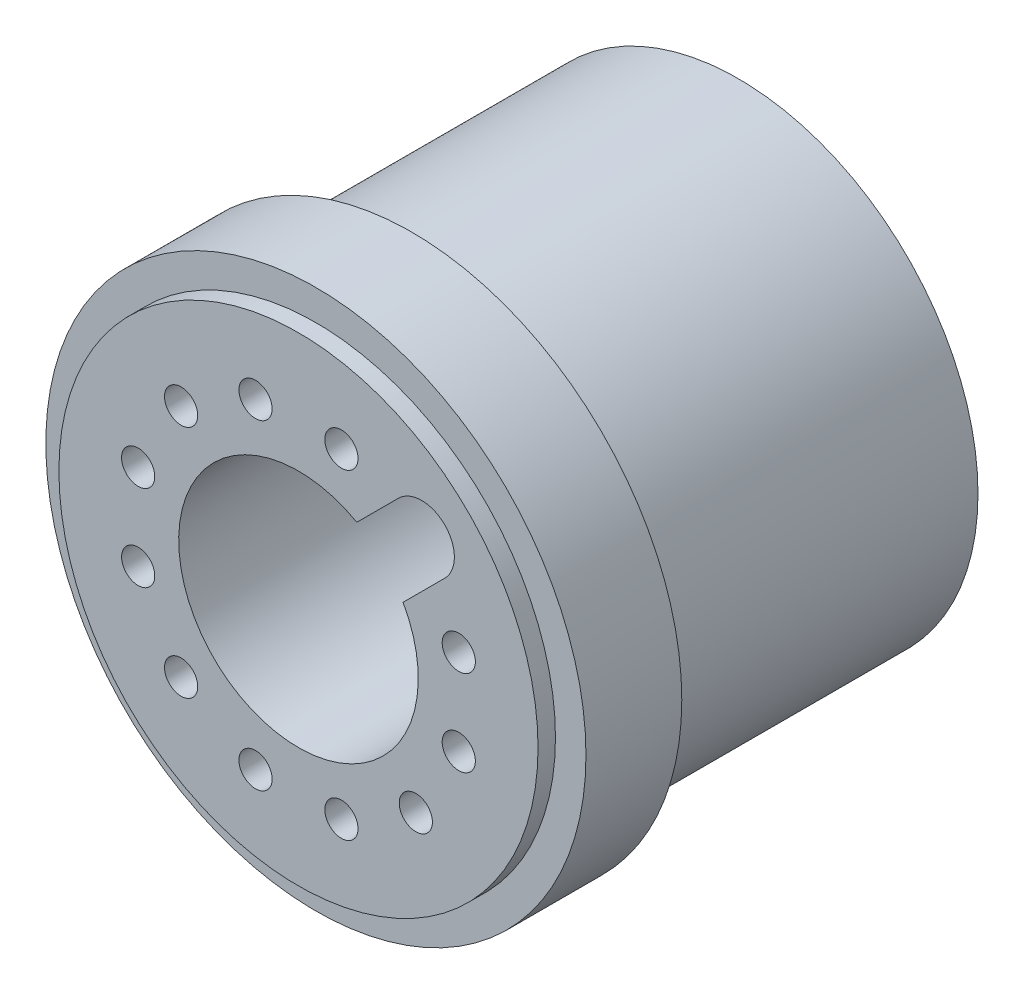
ISO-10303-21;
HEADER;
FILE_DESCRIPTION(('STEP AP214'),'2;1');
FILE_NAME('part.step','',(''),(''),'','','');
FILE_SCHEMA(('AUTOMOTIVE_DESIGN { 1 0 10303 214 1 1 1 1 }'));
ENDSEC;
DATA;
#1=APPLICATION_CONTEXT('core data for automotive mechanical design processes');
#2=APPLICATION_PROTOCOL_DEFINITION('international standard','automotive_design',2000,#1);
#3=PRODUCT_CONTEXT('',#1,'mechanical');
#4=PRODUCT('Part','Part','',(#3));
#5=PRODUCT_RELATED_PRODUCT_CATEGORY('part','',(#4));
#6=PRODUCT_DEFINITION_FORMATION('','',#4);
#7=PRODUCT_DEFINITION_CONTEXT('part definition',#1,'design');
#8=PRODUCT_DEFINITION('design','',#6,#7);
#9=PRODUCT_DEFINITION_SHAPE('','',#8);
#10=(LENGTH_UNIT() NAMED_UNIT(*) SI_UNIT(.MILLI.,.METRE.));
#11=(NAMED_UNIT(*) PLANE_ANGLE_UNIT() SI_UNIT($,.RADIAN.));
#12=(NAMED_UNIT(*) SI_UNIT($,.STERADIAN.) SOLID_ANGLE_UNIT());
#13=UNCERTAINTY_MEASURE_WITH_UNIT(LENGTH_MEASURE(1.E-05),#10,'distance_accuracy_value','');
#14=(GEOMETRIC_REPRESENTATION_CONTEXT(3) GLOBAL_UNCERTAINTY_ASSIGNED_CONTEXT((#13)) GLOBAL_UNIT_ASSIGNED_CONTEXT((#10,
#11,#12)) REPRESENTATION_CONTEXT('',''));
#15=CARTESIAN_POINT('',(0.,0.,0.));
#16=DIRECTION('',(0.,0.,1.));
#17=DIRECTION('',(1.,0.,0.));
#18=AXIS2_PLACEMENT_3D('',#15,#16,#17);
#19=CARTESIAN_POINT('',(0.,-21.1534369663591,2.2));
#20=DIRECTION('',(0.,0.,1.));
#21=DIRECTION('',(1.,0.,0.));
#22=AXIS2_PLACEMENT_3D('',#19,#20,#21);
#23=PLANE('',#22);
#24=CARTESIAN_POINT('',(0.,0.,2.2));
#25=DIRECTION('',(0.,0.,1.));
#26=DIRECTION('',(1.,0.,0.));
#27=AXIS2_PLACEMENT_3D('',#24,#25,#26);
#28=CIRCLE('',#27,6.2);
#29=CARTESIAN_POINT('',(6.2,0.,2.2));
#30=VERTEX_POINT('',#29);
#31=EDGE_CURVE('E12',#30,#30,#28,.T.);
#32=ORIENTED_EDGE('',*,*,#31,.T.);
#33=EDGE_LOOP('',(#32));
#34=FACE_BOUND('',#33,.T.);
#35=CARTESIAN_POINT('',(0.,0.,2.2));
#36=DIRECTION('',(0.,0.,1.));
#37=DIRECTION('',(1.,0.,0.));
#38=AXIS2_PLACEMENT_3D('',#35,#36,#37);
#39=CIRCLE('',#38,5.5);
#40=CARTESIAN_POINT('',(5.5,0.,2.2));
#41=VERTEX_POINT('',#40);
#42=EDGE_CURVE('E181',#41,#41,#39,.F.);
#43=ORIENTED_EDGE('',*,*,#42,.T.);
#44=EDGE_LOOP('',(#43));
#45=FACE_BOUND('',#44,.T.);
#46=ADVANCED_FACE('F35',(#34,#45),#23,.T.);
#47=CARTESIAN_POINT('',(0.,0.,2.2));
#48=DIRECTION('',(0.,0.,-1.));
#49=DIRECTION('',(-1.,0.,0.));
#50=AXIS2_PLACEMENT_3D('',#47,#48,#49);
#51=CYLINDRICAL_SURFACE('',#50,6.2);
#52=ORIENTED_EDGE('',*,*,#31,.F.);
#53=EDGE_LOOP('',(#52));
#54=FACE_BOUND('',#53,.T.);
#55=CARTESIAN_POINT('',(0.,0.,0.));
#56=DIRECTION('',(0.,0.,1.));
#57=DIRECTION('',(1.,0.,0.));
#58=AXIS2_PLACEMENT_3D('',#55,#56,#57);
#59=CIRCLE('',#58,6.2);
#60=CARTESIAN_POINT('',(6.2,0.,0.));
#61=VERTEX_POINT('',#60);
#62=EDGE_CURVE('E39',#61,#61,#59,.T.);
#63=ORIENTED_EDGE('',*,*,#62,.T.);
#64=EDGE_LOOP('',(#63));
#65=FACE_BOUND('',#64,.T.);
#66=ADVANCED_FACE('F37',(#54,#65),#51,.T.);
#67=CARTESIAN_POINT('',(0.,0.,2.2));
#68=DIRECTION('',(0.,0.,-1.));
#69=DIRECTION('',(-1.,0.,0.));
#70=AXIS2_PLACEMENT_3D('',#67,#68,#69);
#71=CYLINDRICAL_SURFACE('',#70,2.75);
#72=DIRECTION('',(0.,0.,1.));
#73=VECTOR('',#72,1.);
#74=CARTESIAN_POINT('',(2.40115877927687,1.34049860749707,0.6));
#75=LINE('',#74,#73);
#76=CARTESIAN_POINT('',(2.40115877927687,1.34049860749707,0.6));
#77=VERTEX_POINT('',#76);
#78=CARTESIAN_POINT('',(2.40115877927687,1.34049860749707,2.6));
#79=VERTEX_POINT('',#78);
#80=EDGE_CURVE('E87',#77,#79,#75,.T.);
#81=ORIENTED_EDGE('',*,*,#80,.F.);
#82=CARTESIAN_POINT('',(0.,0.,0.6));
#83=DIRECTION('',(0.,0.,1.));
#84=DIRECTION('',(1.,0.,0.));
#85=AXIS2_PLACEMENT_3D('',#82,#83,#84);
#86=CIRCLE('',#85,2.75);
#87=CARTESIAN_POINT('',(1.34049860749705,2.40115877927689,0.6));
#88=VERTEX_POINT('',#87);
#89=EDGE_CURVE('E93',#77,#88,#86,.T.);
#90=ORIENTED_EDGE('',*,*,#89,.T.);
#91=DIRECTION('',(0.,0.,1.));
#92=VECTOR('',#91,1.);
#93=CARTESIAN_POINT('',(1.34049860749705,2.40115877927689,0.6));
#94=LINE('',#93,#92);
#95=CARTESIAN_POINT('',(1.34049860749705,2.40115877927689,2.6));
#96=VERTEX_POINT('',#95);
#97=EDGE_CURVE('E79',#88,#96,#94,.T.);
#98=ORIENTED_EDGE('',*,*,#97,.T.);
#99=CARTESIAN_POINT('',(0.,0.,2.6));
#100=DIRECTION('',(0.,0.,1.));
#101=DIRECTION('',(1.,0.,0.));
#102=AXIS2_PLACEMENT_3D('',#99,#100,#101);
#103=CIRCLE('',#102,2.75);
#104=EDGE_CURVE('E175',#96,#79,#103,.T.);
#105=ORIENTED_EDGE('',*,*,#104,.T.);
#106=EDGE_LOOP('',(#81,#90,#98,#105));
#107=FACE_BOUND('',#106,.T.);
#108=CARTESIAN_POINT('',(0.,0.,-7.5));
#109=DIRECTION('',(0.,0.,1.));
#110=DIRECTION('',(1.,0.,0.));
#111=AXIS2_PLACEMENT_3D('',#108,#109,#110);
#112=CIRCLE('',#111,2.75);
#113=CARTESIAN_POINT('',(2.75,0.,-7.5));
#114=VERTEX_POINT('',#113);
#115=EDGE_CURVE('E186',#114,#114,#112,.T.);
#116=ORIENTED_EDGE('',*,*,#115,.F.);
#117=EDGE_LOOP('',(#116));
#118=FACE_BOUND('',#117,.T.);
#119=ADVANCED_FACE('F97',(#107,#118),#71,.F.);
#120=CARTESIAN_POINT('',(0.,-21.1534369663591,0.));
#121=DIRECTION('',(0.,0.,1.));
#122=DIRECTION('',(1.,0.,0.));
#123=AXIS2_PLACEMENT_3D('',#120,#121,#122);
#124=PLANE('',#123);
#125=CARTESIAN_POINT('',(0.,0.,0.));
#126=DIRECTION('',(0.,0.,1.));
#127=DIRECTION('',(1.,0.,0.));
#128=AXIS2_PLACEMENT_3D('',#125,#126,#127);
#129=CIRCLE('',#128,5.5);
#130=CARTESIAN_POINT('',(5.5,0.,0.));
#131=VERTEX_POINT('',#130);
#132=EDGE_CURVE('E185',#131,#131,#129,.T.);
#133=ORIENTED_EDGE('',*,*,#132,.T.);
#134=EDGE_LOOP('',(#133));
#135=FACE_BOUND('',#134,.T.);
#136=ORIENTED_EDGE('',*,*,#62,.F.);
#137=EDGE_LOOP('',(#136));
#138=FACE_BOUND('',#137,.T.);
#139=ADVANCED_FACE('F195',(#135,#138),#124,.F.);
#140=CARTESIAN_POINT('',(0.,0.,-7.5));
#141=DIRECTION('',(0.,0.,1.));
#142=DIRECTION('',(1.,0.,0.));
#143=AXIS2_PLACEMENT_3D('',#140,#141,#142);
#144=CYLINDRICAL_SURFACE('',#143,5.5);
#145=CARTESIAN_POINT('',(0.,0.,-7.5));
#146=DIRECTION('',(0.,0.,1.));
#147=DIRECTION('',(1.,0.,0.));
#148=AXIS2_PLACEMENT_3D('',#145,#146,#147);
#149=CIRCLE('',#148,5.5);
#150=CARTESIAN_POINT('',(5.5,0.,-7.5));
#151=VERTEX_POINT('',#150);
#152=EDGE_CURVE('E189',#151,#151,#149,.T.);
#153=ORIENTED_EDGE('',*,*,#152,.T.);
#154=EDGE_LOOP('',(#153));
#155=FACE_BOUND('',#154,.T.);
#156=ORIENTED_EDGE('',*,*,#132,.F.);
#157=EDGE_LOOP('',(#156));
#158=FACE_BOUND('',#157,.T.);
#159=ADVANCED_FACE('F198',(#155,#158),#144,.T.);
#160=CARTESIAN_POINT('',(0.,-21.1534369663591,-7.5));
#161=DIRECTION('',(0.,0.,1.));
#162=DIRECTION('',(1.,0.,0.));
#163=AXIS2_PLACEMENT_3D('',#160,#161,#162);
#164=PLANE('',#163);
#165=CARTESIAN_POINT('',(3.68017739816134,0.986100561840645,-7.5));
#166=DIRECTION('',(0.,0.,1.));
#167=DIRECTION('',(0.50000000000001,-0.866025403784433,0.));
#168=AXIS2_PLACEMENT_3D('',#165,#166,#167);
#169=CIRCLE('',#168,0.381);
#170=CARTESIAN_POINT('',(3.87067739816134,0.656144882998776,-7.5));
#171=VERTEX_POINT('',#170);
#172=EDGE_CURVE('E109',#171,#171,#169,.T.);
#173=ORIENTED_EDGE('',*,*,#172,.T.);
#174=EDGE_LOOP('',(#173));
#175=FACE_BOUND('',#174,.T.);
#176=CARTESIAN_POINT('',(3.68017739816136,-0.986100561840567,-7.5));
#177=DIRECTION('',(0.,0.,1.));
#178=DIRECTION('',(0.,-1.,0.));
#179=AXIS2_PLACEMENT_3D('',#176,#177,#178);
#180=CIRCLE('',#179,0.381);
#181=CARTESIAN_POINT('',(3.68017739816136,-1.36710056184057,-7.5));
#182=VERTEX_POINT('',#181);
#183=EDGE_CURVE('E117',#182,#182,#180,.T.);
#184=ORIENTED_EDGE('',*,*,#183,.T.);
#185=EDGE_LOOP('',(#184));
#186=FACE_BOUND('',#185,.T.);
#187=CARTESIAN_POINT('',(2.69407683632077,-2.69407683632072,-7.5));
#188=DIRECTION('',(0.,0.,1.));
#189=DIRECTION('',(-0.499999999999992,-0.866025403784443,0.));
#190=AXIS2_PLACEMENT_3D('',#187,#188,#189);
#191=CIRCLE('',#190,0.381);
#192=CARTESIAN_POINT('',(2.50357683632077,-3.0240325151626,-7.5));
#193=VERTEX_POINT('',#192);
#194=EDGE_CURVE('E123',#193,#193,#191,.T.);
#195=ORIENTED_EDGE('',*,*,#194,.T.);
#196=EDGE_LOOP('',(#195));
#197=FACE_BOUND('',#196,.T.);
#198=CARTESIAN_POINT('',(0.986100561840633,-3.68017739816134,-7.5));
#199=DIRECTION('',(0.,0.,1.));
#200=DIRECTION('',(-0.866025403784435,-0.500000000000007,0.));
#201=AXIS2_PLACEMENT_3D('',#198,#199,#200);
#202=CIRCLE('',#201,0.381);
#203=CARTESIAN_POINT('',(0.656144882998763,-3.87067739816135,-7.5));
#204=VERTEX_POINT('',#203);
#205=EDGE_CURVE('E129',#204,#204,#202,.T.);
#206=ORIENTED_EDGE('',*,*,#205,.T.);
#207=EDGE_LOOP('',(#206));
#208=FACE_BOUND('',#207,.T.);
#209=CARTESIAN_POINT('',(-0.98610056184058,-3.68017739816136,-7.5));
#210=DIRECTION('',(0.,0.,1.));
#211=DIRECTION('',(-1.,0.,0.));
#212=AXIS2_PLACEMENT_3D('',#209,#210,#211);
#213=CIRCLE('',#212,0.381);
#214=CARTESIAN_POINT('',(-1.36710056184058,-3.68017739816136,-7.5));
#215=VERTEX_POINT('',#214);
#216=EDGE_CURVE('E135',#215,#215,#213,.T.);
#217=ORIENTED_EDGE('',*,*,#216,.T.);
#218=EDGE_LOOP('',(#217));
#219=FACE_BOUND('',#218,.T.);
#220=CARTESIAN_POINT('',(-2.69407683632073,-2.69407683632076,-7.5));
#221=DIRECTION('',(0.,0.,1.));
#222=DIRECTION('',(-0.866025403784442,0.499999999999995,0.));
#223=AXIS2_PLACEMENT_3D('',#220,#221,#222);
#224=CIRCLE('',#223,0.381);
#225=CARTESIAN_POINT('',(-3.0240325151626,-2.50357683632076,-7.5));
#226=VERTEX_POINT('',#225);
#227=EDGE_CURVE('E141',#226,#226,#224,.T.);
#228=ORIENTED_EDGE('',*,*,#227,.T.);
#229=EDGE_LOOP('',(#228));
#230=FACE_BOUND('',#229,.T.);
#231=CARTESIAN_POINT('',(-3.68017739816135,-0.98610056184062,-7.5));
#232=DIRECTION('',(0.,0.,1.));
#233=DIRECTION('',(-0.500000000000004,0.866025403784436,0.));
#234=AXIS2_PLACEMENT_3D('',#231,#232,#233);
#235=CIRCLE('',#234,0.381);
#236=CARTESIAN_POINT('',(-3.87067739816135,-0.656144882998749,-7.5));
#237=VERTEX_POINT('',#236);
#238=EDGE_CURVE('E147',#237,#237,#235,.T.);
#239=ORIENTED_EDGE('',*,*,#238,.T.);
#240=EDGE_LOOP('',(#239));
#241=FACE_BOUND('',#240,.T.);
#242=CARTESIAN_POINT('',(-3.68017739816135,0.986100561840593,-7.5));
#243=DIRECTION('',(0.,0.,1.));
#244=DIRECTION('',(0.,1.,0.));
#245=AXIS2_PLACEMENT_3D('',#242,#243,#244);
#246=CIRCLE('',#245,0.381);
#247=CARTESIAN_POINT('',(-3.68017739816135,1.36710056184059,-7.5));
#248=VERTEX_POINT('',#247);
#249=EDGE_CURVE('E153',#248,#248,#246,.T.);
#250=ORIENTED_EDGE('',*,*,#249,.T.);
#251=EDGE_LOOP('',(#250));
#252=FACE_BOUND('',#251,.T.);
#253=CARTESIAN_POINT('',(-2.69407683632075,2.69407683632074,-7.5));
#254=DIRECTION('',(0.,0.,1.));
#255=DIRECTION('',(0.499999999999998,0.86602540378444,0.));
#256=AXIS2_PLACEMENT_3D('',#253,#254,#255);
#257=CIRCLE('',#256,0.381);
#258=CARTESIAN_POINT('',(-2.50357683632075,3.02403251516261,-7.5));
#259=VERTEX_POINT('',#258);
#260=EDGE_CURVE('E159',#259,#259,#257,.T.);
#261=ORIENTED_EDGE('',*,*,#260,.T.);
#262=EDGE_LOOP('',(#261));
#263=FACE_BOUND('',#262,.T.);
#264=CARTESIAN_POINT('',(-0.986100561840607,3.68017739816135,-7.5));
#265=DIRECTION('',(0.,0.,1.));
#266=DIRECTION('',(0.866025403784438,0.500000000000001,0.));
#267=AXIS2_PLACEMENT_3D('',#264,#265,#266);
#268=CIRCLE('',#267,0.381);
#269=CARTESIAN_POINT('',(-0.656144882998736,3.87067739816135,-7.5));
#270=VERTEX_POINT('',#269);
#271=EDGE_CURVE('E165',#270,#270,#268,.T.);
#272=ORIENTED_EDGE('',*,*,#271,.T.);
#273=EDGE_LOOP('',(#272));
#274=FACE_BOUND('',#273,.T.);
#275=CARTESIAN_POINT('',(0.986100561840606,3.68017739816135,-7.5));
#276=DIRECTION('',(0.,0.,1.));
#277=DIRECTION('',(1.,0.,0.));
#278=AXIS2_PLACEMENT_3D('',#275,#276,#277);
#279=CIRCLE('',#278,0.381);
#280=CARTESIAN_POINT('',(1.36710056184061,3.68017739816135,-7.5));
#281=VERTEX_POINT('',#280);
#282=EDGE_CURVE('E172',#281,#281,#279,.T.);
#283=ORIENTED_EDGE('',*,*,#282,.T.);
#284=EDGE_LOOP('',(#283));
#285=FACE_BOUND('',#284,.T.);
#286=ORIENTED_EDGE('',*,*,#115,.T.);
#287=EDGE_LOOP('',(#286));
#288=FACE_BOUND('',#287,.T.);
#289=ORIENTED_EDGE('',*,*,#152,.F.);
#290=EDGE_LOOP('',(#289));
#291=FACE_BOUND('',#290,.T.);
#292=ADVANCED_FACE('F200',(#175,#186,#197,#208,#219,#230,#241,#252,#263,#274,#285,#288,#291),
#164,.F.);
#293=CARTESIAN_POINT('',(0.,0.,18.556349186104));
#294=DIRECTION('',(0.,0.,-1.));
#295=DIRECTION('',(-1.,0.,0.));
#296=AXIS2_PLACEMENT_3D('',#293,#294,#295);
#297=CYLINDRICAL_SURFACE('',#296,5.5);
#298=ORIENTED_EDGE('',*,*,#42,.F.);
#299=EDGE_LOOP('',(#298));
#300=FACE_BOUND('',#299,.T.);
#301=CARTESIAN_POINT('',(0.,0.,2.6));
#302=DIRECTION('',(0.,0.,1.));
#303=DIRECTION('',(1.,0.,0.));
#304=AXIS2_PLACEMENT_3D('',#301,#302,#303);
#305=CIRCLE('',#304,5.5);
#306=CARTESIAN_POINT('',(5.5,0.,2.6));
#307=VERTEX_POINT('',#306);
#308=EDGE_CURVE('E178',#307,#307,#305,.T.);
#309=ORIENTED_EDGE('',*,*,#308,.F.);
#310=EDGE_LOOP('',(#309));
#311=FACE_BOUND('',#310,.T.);
#312=ADVANCED_FACE('F207',(#300,#311),#297,.T.);
#313=CARTESIAN_POINT('',(0.,-21.1534369663591,2.6));
#314=DIRECTION('',(0.,0.,1.));
#315=DIRECTION('',(1.,0.,0.));
#316=AXIS2_PLACEMENT_3D('',#313,#314,#315);
#317=PLANE('',#316);
#318=DIRECTION('',(0.707106781186543,0.707106781186552,0.));
#319=VECTOR('',#318,1.);
#320=CARTESIAN_POINT('',(-5.59038059222874,-6.65104076400863,2.6));
#321=LINE('',#320,#319);
#322=CARTESIAN_POINT('',(3.35875721063609,2.2980970388563,2.6));
#323=VERTEX_POINT('',#322);
#324=EDGE_CURVE('E106',#79,#323,#321,.T.);
#325=ORIENTED_EDGE('',*,*,#324,.F.);
#326=ORIENTED_EDGE('',*,*,#104,.F.);
#327=DIRECTION('',(0.707106781186543,0.707106781186552,0.));
#328=VECTOR('',#327,1.);
#329=CARTESIAN_POINT('',(-6.65104076400856,-5.59038059222882,2.6));
#330=LINE('',#329,#328);
#331=CARTESIAN_POINT('',(2.29809703885626,3.35875721063611,2.6));
#332=VERTEX_POINT('',#331);
#333=EDGE_CURVE('E82',#96,#332,#330,.T.);
#334=ORIENTED_EDGE('',*,*,#333,.T.);
#335=CARTESIAN_POINT('',(2.82842712474617,2.82842712474621,2.6));
#336=DIRECTION('',(0.,0.,1.));
#337=DIRECTION('',(1.,0.,0.));
#338=AXIS2_PLACEMENT_3D('',#335,#336,#337);
#339=CIRCLE('',#338,0.75);
#340=EDGE_CURVE('E50',#332,#323,#339,.F.);
#341=ORIENTED_EDGE('',*,*,#340,.T.);
#342=EDGE_LOOP('',(#325,#326,#334,#341));
#343=FACE_BOUND('',#342,.T.);
#344=CARTESIAN_POINT('',(3.68017739816134,0.986100561840645,2.6));
#345=DIRECTION('',(0.,0.,1.));
#346=DIRECTION('',(0.50000000000001,-0.866025403784433,0.));
#347=AXIS2_PLACEMENT_3D('',#344,#345,#346);
#348=CIRCLE('',#347,0.381);
#349=CARTESIAN_POINT('',(3.87067739816134,0.656144882998776,2.6));
#350=VERTEX_POINT('',#349);
#351=EDGE_CURVE('E114',#350,#350,#348,.T.);
#352=ORIENTED_EDGE('',*,*,#351,.F.);
#353=EDGE_LOOP('',(#352));
#354=FACE_BOUND('',#353,.T.);
#355=CARTESIAN_POINT('',(3.68017739816136,-0.986100561840567,2.6));
#356=DIRECTION('',(0.,0.,1.));
#357=DIRECTION('',(0.,-1.,0.));
#358=AXIS2_PLACEMENT_3D('',#355,#356,#357);
#359=CIRCLE('',#358,0.381);
#360=CARTESIAN_POINT('',(3.68017739816136,-1.36710056184057,2.6));
#361=VERTEX_POINT('',#360);
#362=EDGE_CURVE('E120',#361,#361,#359,.T.);
#363=ORIENTED_EDGE('',*,*,#362,.F.);
#364=EDGE_LOOP('',(#363));
#365=FACE_BOUND('',#364,.T.);
#366=CARTESIAN_POINT('',(2.69407683632077,-2.69407683632072,2.6));
#367=DIRECTION('',(0.,0.,1.));
#368=DIRECTION('',(-0.499999999999992,-0.866025403784443,0.));
#369=AXIS2_PLACEMENT_3D('',#366,#367,#368);
#370=CIRCLE('',#369,0.381);
#371=CARTESIAN_POINT('',(2.50357683632077,-3.0240325151626,2.6));
#372=VERTEX_POINT('',#371);
#373=EDGE_CURVE('E126',#372,#372,#370,.T.);
#374=ORIENTED_EDGE('',*,*,#373,.F.);
#375=EDGE_LOOP('',(#374));
#376=FACE_BOUND('',#375,.T.);
#377=CARTESIAN_POINT('',(0.986100561840633,-3.68017739816134,2.6));
#378=DIRECTION('',(0.,0.,1.));
#379=DIRECTION('',(-0.866025403784435,-0.500000000000007,0.));
#380=AXIS2_PLACEMENT_3D('',#377,#378,#379);
#381=CIRCLE('',#380,0.381);
#382=CARTESIAN_POINT('',(0.656144882998763,-3.87067739816135,2.6));
#383=VERTEX_POINT('',#382);
#384=EDGE_CURVE('E132',#383,#383,#381,.T.);
#385=ORIENTED_EDGE('',*,*,#384,.F.);
#386=EDGE_LOOP('',(#385));
#387=FACE_BOUND('',#386,.T.);
#388=CARTESIAN_POINT('',(-0.98610056184058,-3.68017739816136,2.6));
#389=DIRECTION('',(0.,0.,1.));
#390=DIRECTION('',(-1.,0.,0.));
#391=AXIS2_PLACEMENT_3D('',#388,#389,#390);
#392=CIRCLE('',#391,0.381);
#393=CARTESIAN_POINT('',(-1.36710056184058,-3.68017739816136,2.6));
#394=VERTEX_POINT('',#393);
#395=EDGE_CURVE('E138',#394,#394,#392,.T.);
#396=ORIENTED_EDGE('',*,*,#395,.F.);
#397=EDGE_LOOP('',(#396));
#398=FACE_BOUND('',#397,.T.);
#399=CARTESIAN_POINT('',(-2.69407683632073,-2.69407683632076,2.6));
#400=DIRECTION('',(0.,0.,1.));
#401=DIRECTION('',(-0.866025403784442,0.499999999999995,0.));
#402=AXIS2_PLACEMENT_3D('',#399,#400,#401);
#403=CIRCLE('',#402,0.381);
#404=CARTESIAN_POINT('',(-3.0240325151626,-2.50357683632076,2.6));
#405=VERTEX_POINT('',#404);
#406=EDGE_CURVE('E144',#405,#405,#403,.T.);
#407=ORIENTED_EDGE('',*,*,#406,.F.);
#408=EDGE_LOOP('',(#407));
#409=FACE_BOUND('',#408,.T.);
#410=CARTESIAN_POINT('',(-3.68017739816135,-0.98610056184062,2.6));
#411=DIRECTION('',(0.,0.,1.));
#412=DIRECTION('',(-0.500000000000004,0.866025403784436,0.));
#413=AXIS2_PLACEMENT_3D('',#410,#411,#412);
#414=CIRCLE('',#413,0.381);
#415=CARTESIAN_POINT('',(-3.87067739816135,-0.656144882998749,2.6));
#416=VERTEX_POINT('',#415);
#417=EDGE_CURVE('E150',#416,#416,#414,.T.);
#418=ORIENTED_EDGE('',*,*,#417,.F.);
#419=EDGE_LOOP('',(#418));
#420=FACE_BOUND('',#419,.T.);
#421=CARTESIAN_POINT('',(-3.68017739816135,0.986100561840593,2.6));
#422=DIRECTION('',(0.,0.,1.));
#423=DIRECTION('',(0.,1.,0.));
#424=AXIS2_PLACEMENT_3D('',#421,#422,#423);
#425=CIRCLE('',#424,0.381);
#426=CARTESIAN_POINT('',(-3.68017739816135,1.36710056184059,2.6));
#427=VERTEX_POINT('',#426);
#428=EDGE_CURVE('E156',#427,#427,#425,.T.);
#429=ORIENTED_EDGE('',*,*,#428,.F.);
#430=EDGE_LOOP('',(#429));
#431=FACE_BOUND('',#430,.T.);
#432=CARTESIAN_POINT('',(-2.69407683632075,2.69407683632074,2.6));
#433=DIRECTION('',(0.,0.,1.));
#434=DIRECTION('',(0.499999999999998,0.86602540378444,0.));
#435=AXIS2_PLACEMENT_3D('',#432,#433,#434);
#436=CIRCLE('',#435,0.381);
#437=CARTESIAN_POINT('',(-2.50357683632075,3.02403251516261,2.6));
#438=VERTEX_POINT('',#437);
#439=EDGE_CURVE('E162',#438,#438,#436,.T.);
#440=ORIENTED_EDGE('',*,*,#439,.F.);
#441=EDGE_LOOP('',(#440));
#442=FACE_BOUND('',#441,.T.);
#443=CARTESIAN_POINT('',(-0.986100561840607,3.68017739816135,2.6));
#444=DIRECTION('',(0.,0.,1.));
#445=DIRECTION('',(0.866025403784438,0.500000000000001,0.));
#446=AXIS2_PLACEMENT_3D('',#443,#444,#445);
#447=CIRCLE('',#446,0.381);
#448=CARTESIAN_POINT('',(-0.656144882998736,3.87067739816135,2.6));
#449=VERTEX_POINT('',#448);
#450=EDGE_CURVE('E168',#449,#449,#447,.T.);
#451=ORIENTED_EDGE('',*,*,#450,.F.);
#452=EDGE_LOOP('',(#451));
#453=FACE_BOUND('',#452,.T.);
#454=CARTESIAN_POINT('',(0.986100561840606,3.68017739816135,2.6));
#455=DIRECTION('',(0.,0.,1.));
#456=DIRECTION('',(1.,0.,0.));
#457=AXIS2_PLACEMENT_3D('',#454,#455,#456);
#458=CIRCLE('',#457,0.381);
#459=CARTESIAN_POINT('',(1.36710056184061,3.68017739816135,2.6));
#460=VERTEX_POINT('',#459);
#461=EDGE_CURVE('E171',#460,#460,#458,.T.);
#462=ORIENTED_EDGE('',*,*,#461,.F.);
#463=EDGE_LOOP('',(#462));
#464=FACE_BOUND('',#463,.T.);
#465=ORIENTED_EDGE('',*,*,#308,.T.);
#466=EDGE_LOOP('',(#465));
#467=FACE_BOUND('',#466,.T.);
#468=ADVANCED_FACE('F253',(#343,#354,#365,#376,#387,#398,#409,#420,#431,#442,#453,#464,#467),
#317,.T.);
#469=CARTESIAN_POINT('',(0.986100561840606,3.68017739816135,-7.5));
#470=DIRECTION('',(0.,0.,1.));
#471=DIRECTION('',(1.,0.,0.));
#472=AXIS2_PLACEMENT_3D('',#469,#470,#471);
#473=CYLINDRICAL_SURFACE('',#472,0.381);
#474=ORIENTED_EDGE('',*,*,#282,.F.);
#475=EDGE_LOOP('',(#474));
#476=FACE_BOUND('',#475,.T.);
#477=ORIENTED_EDGE('',*,*,#461,.T.);
#478=EDGE_LOOP('',(#477));
#479=FACE_BOUND('',#478,.T.);
#480=ADVANCED_FACE('F261',(#476,#479),#473,.F.);
#481=CARTESIAN_POINT('',(-0.986100561840607,3.68017739816135,-7.5));
#482=DIRECTION('',(0.,0.,1.));
#483=DIRECTION('',(0.866025403784438,0.500000000000001,0.));
#484=AXIS2_PLACEMENT_3D('',#481,#482,#483);
#485=CYLINDRICAL_SURFACE('',#484,0.381);
#486=ORIENTED_EDGE('',*,*,#271,.F.);
#487=EDGE_LOOP('',(#486));
#488=FACE_BOUND('',#487,.T.);
#489=ORIENTED_EDGE('',*,*,#450,.T.);
#490=EDGE_LOOP('',(#489));
#491=FACE_BOUND('',#490,.T.);
#492=ADVANCED_FACE('F266',(#488,#491),#485,.F.);
#493=CARTESIAN_POINT('',(-2.69407683632075,2.69407683632074,-7.5));
#494=DIRECTION('',(0.,0.,1.));
#495=DIRECTION('',(0.499999999999998,0.86602540378444,0.));
#496=AXIS2_PLACEMENT_3D('',#493,#494,#495);
#497=CYLINDRICAL_SURFACE('',#496,0.381);
#498=ORIENTED_EDGE('',*,*,#260,.F.);
#499=EDGE_LOOP('',(#498));
#500=FACE_BOUND('',#499,.T.);
#501=ORIENTED_EDGE('',*,*,#439,.T.);
#502=EDGE_LOOP('',(#501));
#503=FACE_BOUND('',#502,.T.);
#504=ADVANCED_FACE('F281',(#500,#503),#497,.F.);
#505=CARTESIAN_POINT('',(-3.68017739816135,0.986100561840593,-7.5));
#506=DIRECTION('',(0.,0.,1.));
#507=DIRECTION('',(0.,1.,0.));
#508=AXIS2_PLACEMENT_3D('',#505,#506,#507);
#509=CYLINDRICAL_SURFACE('',#508,0.381);
#510=ORIENTED_EDGE('',*,*,#249,.F.);
#511=EDGE_LOOP('',(#510));
#512=FACE_BOUND('',#511,.T.);
#513=ORIENTED_EDGE('',*,*,#428,.T.);
#514=EDGE_LOOP('',(#513));
#515=FACE_BOUND('',#514,.T.);
#516=ADVANCED_FACE('F291',(#512,#515),#509,.F.);
#517=CARTESIAN_POINT('',(-3.68017739816135,-0.98610056184062,-7.5));
#518=DIRECTION('',(0.,0.,1.));
#519=DIRECTION('',(-0.500000000000004,0.866025403784436,0.));
#520=AXIS2_PLACEMENT_3D('',#517,#518,#519);
#521=CYLINDRICAL_SURFACE('',#520,0.381);
#522=ORIENTED_EDGE('',*,*,#238,.F.);
#523=EDGE_LOOP('',(#522));
#524=FACE_BOUND('',#523,.T.);
#525=ORIENTED_EDGE('',*,*,#417,.T.);
#526=EDGE_LOOP('',(#525));
#527=FACE_BOUND('',#526,.T.);
#528=ADVANCED_FACE('F301',(#524,#527),#521,.F.);
#529=CARTESIAN_POINT('',(-2.69407683632073,-2.69407683632076,-7.5));
#530=DIRECTION('',(0.,0.,1.));
#531=DIRECTION('',(-0.866025403784442,0.499999999999995,0.));
#532=AXIS2_PLACEMENT_3D('',#529,#530,#531);
#533=CYLINDRICAL_SURFACE('',#532,0.381);
#534=ORIENTED_EDGE('',*,*,#227,.F.);
#535=EDGE_LOOP('',(#534));
#536=FACE_BOUND('',#535,.T.);
#537=ORIENTED_EDGE('',*,*,#406,.T.);
#538=EDGE_LOOP('',(#537));
#539=FACE_BOUND('',#538,.T.);
#540=ADVANCED_FACE('F311',(#536,#539),#533,.F.);
#541=CARTESIAN_POINT('',(-0.98610056184058,-3.68017739816136,-7.5));
#542=DIRECTION('',(0.,0.,1.));
#543=DIRECTION('',(-1.,0.,0.));
#544=AXIS2_PLACEMENT_3D('',#541,#542,#543);
#545=CYLINDRICAL_SURFACE('',#544,0.381);
#546=ORIENTED_EDGE('',*,*,#216,.F.);
#547=EDGE_LOOP('',(#546));
#548=FACE_BOUND('',#547,.T.);
#549=ORIENTED_EDGE('',*,*,#395,.T.);
#550=EDGE_LOOP('',(#549));
#551=FACE_BOUND('',#550,.T.);
#552=ADVANCED_FACE('F321',(#548,#551),#545,.F.);
#553=CARTESIAN_POINT('',(0.986100561840633,-3.68017739816134,-7.5));
#554=DIRECTION('',(0.,0.,1.));
#555=DIRECTION('',(-0.866025403784435,-0.500000000000007,0.));
#556=AXIS2_PLACEMENT_3D('',#553,#554,#555);
#557=CYLINDRICAL_SURFACE('',#556,0.381);
#558=ORIENTED_EDGE('',*,*,#205,.F.);
#559=EDGE_LOOP('',(#558));
#560=FACE_BOUND('',#559,.T.);
#561=ORIENTED_EDGE('',*,*,#384,.T.);
#562=EDGE_LOOP('',(#561));
#563=FACE_BOUND('',#562,.T.);
#564=ADVANCED_FACE('F331',(#560,#563),#557,.F.);
#565=CARTESIAN_POINT('',(2.69407683632077,-2.69407683632072,-7.5));
#566=DIRECTION('',(0.,0.,1.));
#567=DIRECTION('',(-0.499999999999992,-0.866025403784443,0.));
#568=AXIS2_PLACEMENT_3D('',#565,#566,#567);
#569=CYLINDRICAL_SURFACE('',#568,0.381);
#570=ORIENTED_EDGE('',*,*,#194,.F.);
#571=EDGE_LOOP('',(#570));
#572=FACE_BOUND('',#571,.T.);
#573=ORIENTED_EDGE('',*,*,#373,.T.);
#574=EDGE_LOOP('',(#573));
#575=FACE_BOUND('',#574,.T.);
#576=ADVANCED_FACE('F341',(#572,#575),#569,.F.);
#577=CARTESIAN_POINT('',(3.68017739816136,-0.986100561840567,-7.5));
#578=DIRECTION('',(0.,0.,1.));
#579=DIRECTION('',(0.,-1.,0.));
#580=AXIS2_PLACEMENT_3D('',#577,#578,#579);
#581=CYLINDRICAL_SURFACE('',#580,0.381);
#582=ORIENTED_EDGE('',*,*,#183,.F.);
#583=EDGE_LOOP('',(#582));
#584=FACE_BOUND('',#583,.T.);
#585=ORIENTED_EDGE('',*,*,#362,.T.);
#586=EDGE_LOOP('',(#585));
#587=FACE_BOUND('',#586,.T.);
#588=ADVANCED_FACE('F351',(#584,#587),#581,.F.);
#589=CARTESIAN_POINT('',(3.68017739816134,0.986100561840645,-7.5));
#590=DIRECTION('',(0.,0.,1.));
#591=DIRECTION('',(0.50000000000001,-0.866025403784433,0.));
#592=AXIS2_PLACEMENT_3D('',#589,#590,#591);
#593=CYLINDRICAL_SURFACE('',#592,0.381);
#594=ORIENTED_EDGE('',*,*,#172,.F.);
#595=EDGE_LOOP('',(#594));
#596=FACE_BOUND('',#595,.T.);
#597=ORIENTED_EDGE('',*,*,#351,.T.);
#598=EDGE_LOOP('',(#597));
#599=FACE_BOUND('',#598,.T.);
#600=ADVANCED_FACE('F360',(#596,#599),#593,.F.);
#601=CARTESIAN_POINT('',(2.82842712474617,2.82842712474621,0.6));
#602=DIRECTION('',(0.,0.,1.));
#603=DIRECTION('',(1.,0.,0.));
#604=AXIS2_PLACEMENT_3D('',#601,#602,#603);
#605=CYLINDRICAL_SURFACE('',#604,0.75);
#606=ORIENTED_EDGE('',*,*,#340,.F.);
#607=DIRECTION('',(0.,0.,1.));
#608=VECTOR('',#607,1.);
#609=CARTESIAN_POINT('',(2.29809703885626,3.35875721063611,0.6));
#610=LINE('',#609,#608);
#611=CARTESIAN_POINT('',(2.29809703885626,3.35875721063611,0.6));
#612=VERTEX_POINT('',#611);
#613=EDGE_CURVE('E88',#612,#332,#610,.T.);
#614=ORIENTED_EDGE('',*,*,#613,.F.);
#615=CARTESIAN_POINT('',(2.82842712474617,2.82842712474621,0.6));
#616=DIRECTION('',(0.,0.,1.));
#617=DIRECTION('',(1.,0.,0.));
#618=AXIS2_PLACEMENT_3D('',#615,#616,#617);
#619=CIRCLE('',#618,0.75);
#620=CARTESIAN_POINT('',(3.35875721063609,2.2980970388563,0.6));
#621=VERTEX_POINT('',#620);
#622=EDGE_CURVE('E56',#612,#621,#619,.F.);
#623=ORIENTED_EDGE('',*,*,#622,.T.);
#624=DIRECTION('',(0.,0.,1.));
#625=VECTOR('',#624,1.);
#626=CARTESIAN_POINT('',(3.35875721063609,2.2980970388563,0.6));
#627=LINE('',#626,#625);
#628=EDGE_CURVE('E70',#621,#323,#627,.T.);
#629=ORIENTED_EDGE('',*,*,#628,.T.);
#630=EDGE_LOOP('',(#606,#614,#623,#629));
#631=FACE_BOUND('',#630,.T.);
#632=ADVANCED_FACE('F369',(#631),#605,.F.);
#633=CARTESIAN_POINT('',(-5.59038059222874,-6.65104076400863,0.6));
#634=DIRECTION('',(0.707106781186552,-0.707106781186543,0.));
#635=DIRECTION('',(0.707106781186543,0.707106781186552,0.));
#636=AXIS2_PLACEMENT_3D('',#633,#634,#635);
#637=PLANE('',#636);
#638=ORIENTED_EDGE('',*,*,#324,.T.);
#639=ORIENTED_EDGE('',*,*,#628,.F.);
#640=DIRECTION('',(0.707106781186543,0.707106781186552,0.));
#641=VECTOR('',#640,1.);
#642=CARTESIAN_POINT('',(-5.59038059222874,-6.65104076400863,0.6));
#643=LINE('',#642,#641);
#644=EDGE_CURVE('E99',#77,#621,#643,.T.);
#645=ORIENTED_EDGE('',*,*,#644,.F.);
#646=ORIENTED_EDGE('',*,*,#80,.T.);
#647=EDGE_LOOP('',(#638,#639,#645,#646));
#648=FACE_BOUND('',#647,.T.);
#649=ADVANCED_FACE('F380',(#648),#637,.F.);
#650=CARTESIAN_POINT('',(-6.65104076400856,-5.59038059222882,0.6));
#651=DIRECTION('',(0.707106781186552,-0.707106781186543,0.));
#652=DIRECTION('',(0.707106781186543,0.707106781186552,0.));
#653=AXIS2_PLACEMENT_3D('',#650,#651,#652);
#654=PLANE('',#653);
#655=ORIENTED_EDGE('',*,*,#333,.F.);
#656=ORIENTED_EDGE('',*,*,#97,.F.);
#657=DIRECTION('',(0.707106781186543,0.707106781186552,0.));
#658=VECTOR('',#657,1.);
#659=CARTESIAN_POINT('',(-6.65104076400856,-5.59038059222882,0.6));
#660=LINE('',#659,#658);
#661=EDGE_CURVE('E77',#88,#612,#660,.T.);
#662=ORIENTED_EDGE('',*,*,#661,.T.);
#663=ORIENTED_EDGE('',*,*,#613,.T.);
#664=EDGE_LOOP('',(#655,#656,#662,#663));
#665=FACE_BOUND('',#664,.T.);
#666=ADVANCED_FACE('F80',(#665),#654,.T.);
#667=CARTESIAN_POINT('',(0.,-12.2414213562373,0.6));
#668=DIRECTION('',(0.,0.,1.));
#669=DIRECTION('',(1.,0.,0.));
#670=AXIS2_PLACEMENT_3D('',#667,#668,#669);
#671=PLANE('',#670);
#672=ORIENTED_EDGE('',*,*,#622,.F.);
#673=ORIENTED_EDGE('',*,*,#661,.F.);
#674=ORIENTED_EDGE('',*,*,#89,.F.);
#675=ORIENTED_EDGE('',*,*,#644,.T.);
#676=EDGE_LOOP('',(#672,#673,#674,#675));
#677=FACE_BOUND('',#676,.T.);
#678=ADVANCED_FACE('F91',(#677),#671,.T.);
#679=CLOSED_SHELL('',(#46,#66,#119,#139,#159,#292,#312,#468,#480,#492,#504,#516,#528,#540,#552,
#564,#576,#588,#600,#632,#649,#666,#678));
#680=MANIFOLD_SOLID_BREP('B2',#679);
#681=ADVANCED_BREP_SHAPE_REPRESENTATION('',(#18,#680),#14);
#682=SHAPE_DEFINITION_REPRESENTATION(#9,#681);
ENDSEC;
END-ISO-10303-21;
